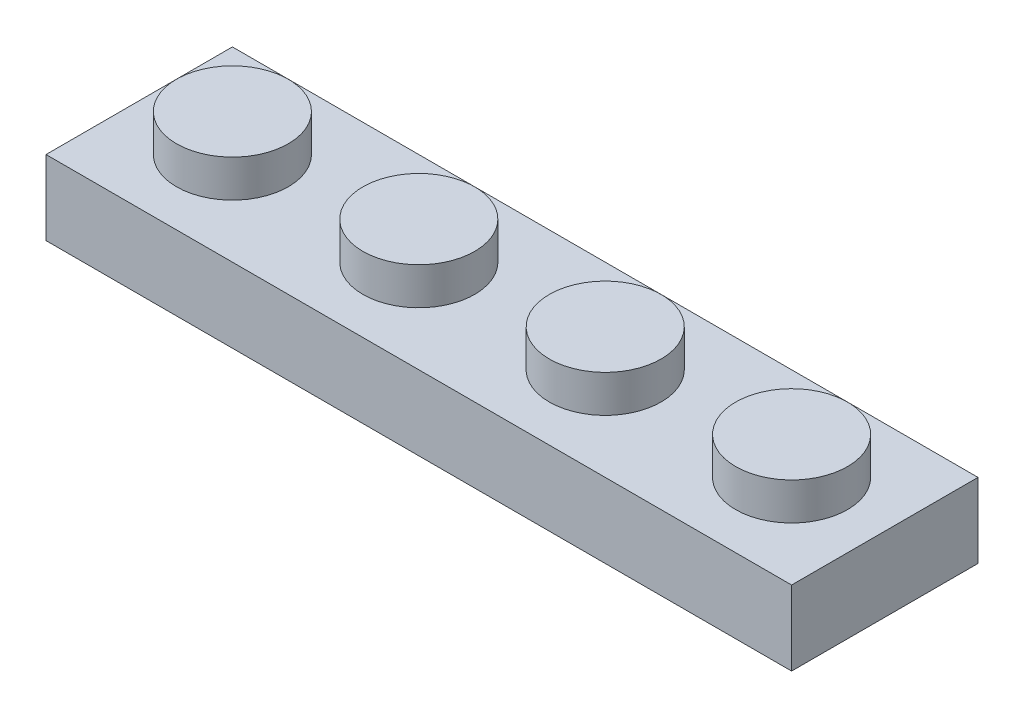
ISO-10303-21;
HEADER;
FILE_DESCRIPTION(('STEP AP214'),'2;1');
FILE_NAME('part.step','',(''),(''),'','','');
FILE_SCHEMA(('AUTOMOTIVE_DESIGN { 1 0 10303 214 1 1 1 1 }'));
ENDSEC;
DATA;
#1=APPLICATION_CONTEXT('core data for automotive mechanical design processes');
#2=APPLICATION_PROTOCOL_DEFINITION('international standard','automotive_design',2000,#1);
#3=PRODUCT_CONTEXT('',#1,'mechanical');
#4=PRODUCT('Part','Part','',(#3));
#5=PRODUCT_RELATED_PRODUCT_CATEGORY('part','',(#4));
#6=PRODUCT_DEFINITION_FORMATION('','',#4);
#7=PRODUCT_DEFINITION_CONTEXT('part definition',#1,'design');
#8=PRODUCT_DEFINITION('design','',#6,#7);
#9=PRODUCT_DEFINITION_SHAPE('','',#8);
#10=(LENGTH_UNIT() NAMED_UNIT(*) SI_UNIT(.MILLI.,.METRE.));
#11=(NAMED_UNIT(*) PLANE_ANGLE_UNIT() SI_UNIT($,.RADIAN.));
#12=(NAMED_UNIT(*) SI_UNIT($,.STERADIAN.) SOLID_ANGLE_UNIT());
#13=UNCERTAINTY_MEASURE_WITH_UNIT(LENGTH_MEASURE(1.E-05),#10,'distance_accuracy_value','');
#14=(GEOMETRIC_REPRESENTATION_CONTEXT(3) GLOBAL_UNCERTAINTY_ASSIGNED_CONTEXT((#13)) GLOBAL_UNIT_ASSIGNED_CONTEXT((#10,
#11,#12)) REPRESENTATION_CONTEXT('',''));
#15=CARTESIAN_POINT('',(0.,0.,0.));
#16=DIRECTION('',(0.,0.,1.));
#17=DIRECTION('',(1.,0.,0.));
#18=AXIS2_PLACEMENT_3D('',#15,#16,#17);
#19=CARTESIAN_POINT('',(-7.5,2.,0.));
#20=DIRECTION('',(0.,-1.,0.));
#21=DIRECTION('',(0.,0.,-1.));
#22=AXIS2_PLACEMENT_3D('',#19,#20,#21);
#23=CYLINDRICAL_SURFACE('',#22,1.5);
#24=CARTESIAN_POINT('',(-7.5,1.,0.));
#25=DIRECTION('',(0.,1.,0.));
#26=DIRECTION('',(0.,0.,1.));
#27=AXIS2_PLACEMENT_3D('',#24,#25,#26);
#28=CIRCLE('',#27,1.5);
#29=CARTESIAN_POINT('',(-7.5,1.,1.5));
#30=VERTEX_POINT('',#29);
#31=EDGE_CURVE('E83',#30,#30,#28,.T.);
#32=ORIENTED_EDGE('',*,*,#31,.T.);
#33=EDGE_LOOP('',(#32));
#34=FACE_BOUND('',#33,.T.);
#35=CARTESIAN_POINT('',(-7.5,2.,0.));
#36=DIRECTION('',(0.,1.,0.));
#37=DIRECTION('',(0.,0.,1.));
#38=AXIS2_PLACEMENT_3D('',#35,#36,#37);
#39=CIRCLE('',#38,1.5);
#40=CARTESIAN_POINT('',(-7.5,2.,1.5));
#41=VERTEX_POINT('',#40);
#42=EDGE_CURVE('E12',#41,#41,#39,.T.);
#43=ORIENTED_EDGE('',*,*,#42,.F.);
#44=EDGE_LOOP('',(#43));
#45=FACE_BOUND('',#44,.T.);
#46=ADVANCED_FACE('F80',(#34,#45),#23,.T.);
#47=CARTESIAN_POINT('',(0.,2.,0.));
#48=DIRECTION('',(0.,1.,0.));
#49=DIRECTION('',(0.,0.,1.));
#50=AXIS2_PLACEMENT_3D('',#47,#48,#49);
#51=PLANE('',#50);
#52=ORIENTED_EDGE('',*,*,#42,.T.);
#53=EDGE_LOOP('',(#52));
#54=FACE_BOUND('',#53,.T.);
#55=ADVANCED_FACE('F294',(#54),#51,.T.);
#56=CARTESIAN_POINT('',(-10.,1.,2.5));
#57=DIRECTION('',(0.,0.,-1.));
#58=DIRECTION('',(-1.,0.,0.));
#59=AXIS2_PLACEMENT_3D('',#56,#57,#58);
#60=PLANE('',#59);
#61=DIRECTION('',(0.,-1.,0.));
#62=VECTOR('',#61,1.);
#63=CARTESIAN_POINT('',(-10.,1.,2.5));
#64=LINE('',#63,#62);
#65=CARTESIAN_POINT('',(-10.,1.,2.5));
#66=VERTEX_POINT('',#65);
#67=CARTESIAN_POINT('',(-10.,-1.,2.5));
#68=VERTEX_POINT('',#67);
#69=EDGE_CURVE('E251',#66,#68,#64,.T.);
#70=ORIENTED_EDGE('',*,*,#69,.T.);
#71=DIRECTION('',(1.,0.,0.));
#72=VECTOR('',#71,1.);
#73=CARTESIAN_POINT('',(0.,-1.,2.5));
#74=LINE('',#73,#72);
#75=CARTESIAN_POINT('',(10.,-1.,2.5));
#76=VERTEX_POINT('',#75);
#77=EDGE_CURVE('E178',#68,#76,#74,.T.);
#78=ORIENTED_EDGE('',*,*,#77,.T.);
#79=DIRECTION('',(0.,-1.,0.));
#80=VECTOR('',#79,1.);
#81=CARTESIAN_POINT('',(10.,1.,2.5));
#82=LINE('',#81,#80);
#83=CARTESIAN_POINT('',(10.,1.,2.5));
#84=VERTEX_POINT('',#83);
#85=EDGE_CURVE('E257',#84,#76,#82,.T.);
#86=ORIENTED_EDGE('',*,*,#85,.F.);
#87=DIRECTION('',(1.,0.,0.));
#88=VECTOR('',#87,1.);
#89=CARTESIAN_POINT('',(-10.,1.,2.5));
#90=LINE('',#89,#88);
#91=EDGE_CURVE('E240',#66,#84,#90,.T.);
#92=ORIENTED_EDGE('',*,*,#91,.F.);
#93=EDGE_LOOP('',(#70,#78,#86,#92));
#94=FACE_BOUND('',#93,.T.);
#95=ADVANCED_FACE('F278',(#94),#60,.F.);
#96=CARTESIAN_POINT('',(10.,1.,2.5));
#97=DIRECTION('',(-1.,0.,0.));
#98=DIRECTION('',(0.,0.,1.));
#99=AXIS2_PLACEMENT_3D('',#96,#97,#98);
#100=PLANE('',#99);
#101=ORIENTED_EDGE('',*,*,#85,.T.);
#102=DIRECTION('',(0.,0.,-1.));
#103=VECTOR('',#102,1.);
#104=CARTESIAN_POINT('',(10.,-1.,0.));
#105=LINE('',#104,#103);
#106=CARTESIAN_POINT('',(10.,-1.,-2.5));
#107=VERTEX_POINT('',#106);
#108=EDGE_CURVE('E181',#76,#107,#105,.T.);
#109=ORIENTED_EDGE('',*,*,#108,.T.);
#110=DIRECTION('',(0.,-1.,0.));
#111=VECTOR('',#110,1.);
#112=CARTESIAN_POINT('',(10.,1.,-2.5));
#113=LINE('',#112,#111);
#114=CARTESIAN_POINT('',(10.,1.,-2.5));
#115=VERTEX_POINT('',#114);
#116=EDGE_CURVE('E255',#115,#107,#113,.T.);
#117=ORIENTED_EDGE('',*,*,#116,.F.);
#118=DIRECTION('',(0.,0.,-1.));
#119=VECTOR('',#118,1.);
#120=CARTESIAN_POINT('',(10.,1.,2.5));
#121=LINE('',#120,#119);
#122=EDGE_CURVE('E243',#84,#115,#121,.T.);
#123=ORIENTED_EDGE('',*,*,#122,.F.);
#124=EDGE_LOOP('',(#101,#109,#117,#123));
#125=FACE_BOUND('',#124,.T.);
#126=ADVANCED_FACE('F282',(#125),#100,.F.);
#127=CARTESIAN_POINT('',(-10.,1.,-2.5));
#128=DIRECTION('',(0.,0.,-1.));
#129=DIRECTION('',(-1.,0.,0.));
#130=AXIS2_PLACEMENT_3D('',#127,#128,#129);
#131=PLANE('',#130);
#132=ORIENTED_EDGE('',*,*,#116,.T.);
#133=DIRECTION('',(1.,0.,0.));
#134=VECTOR('',#133,1.);
#135=CARTESIAN_POINT('',(0.,-1.,-2.5));
#136=LINE('',#135,#134);
#137=CARTESIAN_POINT('',(-10.,-1.,-2.5));
#138=VERTEX_POINT('',#137);
#139=EDGE_CURVE('E184',#138,#107,#136,.T.);
#140=ORIENTED_EDGE('',*,*,#139,.F.);
#141=DIRECTION('',(0.,-1.,0.));
#142=VECTOR('',#141,1.);
#143=CARTESIAN_POINT('',(-10.,1.,-2.5));
#144=LINE('',#143,#142);
#145=CARTESIAN_POINT('',(-10.,1.,-2.5));
#146=VERTEX_POINT('',#145);
#147=EDGE_CURVE('E253',#146,#138,#144,.T.);
#148=ORIENTED_EDGE('',*,*,#147,.F.);
#149=DIRECTION('',(1.,0.,0.));
#150=VECTOR('',#149,1.);
#151=CARTESIAN_POINT('',(-10.,1.,-2.5));
#152=LINE('',#151,#150);
#153=EDGE_CURVE('E245',#146,#115,#152,.T.);
#154=ORIENTED_EDGE('',*,*,#153,.T.);
#155=EDGE_LOOP('',(#132,#140,#148,#154));
#156=FACE_BOUND('',#155,.T.);
#157=ADVANCED_FACE('F284',(#156),#131,.T.);
#158=CARTESIAN_POINT('',(-10.,1.,2.5));
#159=DIRECTION('',(-1.,0.,0.));
#160=DIRECTION('',(0.,0.,1.));
#161=AXIS2_PLACEMENT_3D('',#158,#159,#160);
#162=PLANE('',#161);
#163=ORIENTED_EDGE('',*,*,#147,.T.);
#164=DIRECTION('',(0.,0.,-1.));
#165=VECTOR('',#164,1.);
#166=CARTESIAN_POINT('',(-10.,-1.,0.));
#167=LINE('',#166,#165);
#168=EDGE_CURVE('E164',#68,#138,#167,.T.);
#169=ORIENTED_EDGE('',*,*,#168,.F.);
#170=ORIENTED_EDGE('',*,*,#69,.F.);
#171=DIRECTION('',(0.,0.,-1.));
#172=VECTOR('',#171,1.);
#173=CARTESIAN_POINT('',(-10.,1.,2.5));
#174=LINE('',#173,#172);
#175=EDGE_CURVE('E248',#66,#146,#174,.T.);
#176=ORIENTED_EDGE('',*,*,#175,.T.);
#177=EDGE_LOOP('',(#163,#169,#170,#176));
#178=FACE_BOUND('',#177,.T.);
#179=ADVANCED_FACE('F270',(#178),#162,.T.);
#180=CARTESIAN_POINT('',(0.,1.,0.));
#181=DIRECTION('',(0.,1.,0.));
#182=DIRECTION('',(0.,0.,1.));
#183=AXIS2_PLACEMENT_3D('',#180,#181,#182);
#184=PLANE('',#183);
#185=CARTESIAN_POINT('',(7.5,1.,0.));
#186=DIRECTION('',(0.,1.,0.));
#187=DIRECTION('',(0.,0.,1.));
#188=AXIS2_PLACEMENT_3D('',#185,#186,#187);
#189=CIRCLE('',#188,1.5);
#190=CARTESIAN_POINT('',(7.5,1.,1.5));
#191=VERTEX_POINT('',#190);
#192=EDGE_CURVE('E225',#191,#191,#189,.F.);
#193=ORIENTED_EDGE('',*,*,#192,.T.);
#194=EDGE_LOOP('',(#193));
#195=FACE_BOUND('',#194,.T.);
#196=CARTESIAN_POINT('',(2.5,1.,0.));
#197=DIRECTION('',(0.,1.,0.));
#198=DIRECTION('',(0.,0.,1.));
#199=AXIS2_PLACEMENT_3D('',#196,#197,#198);
#200=CIRCLE('',#199,1.5);
#201=CARTESIAN_POINT('',(2.5,1.,1.5));
#202=VERTEX_POINT('',#201);
#203=EDGE_CURVE('E231',#202,#202,#200,.F.);
#204=ORIENTED_EDGE('',*,*,#203,.T.);
#205=EDGE_LOOP('',(#204));
#206=FACE_BOUND('',#205,.T.);
#207=CARTESIAN_POINT('',(-2.5,1.,0.));
#208=DIRECTION('',(0.,1.,0.));
#209=DIRECTION('',(0.,0.,1.));
#210=AXIS2_PLACEMENT_3D('',#207,#208,#209);
#211=CIRCLE('',#210,1.5);
#212=CARTESIAN_POINT('',(-2.5,1.,1.5));
#213=VERTEX_POINT('',#212);
#214=EDGE_CURVE('E237',#213,#213,#211,.F.);
#215=ORIENTED_EDGE('',*,*,#214,.T.);
#216=EDGE_LOOP('',(#215));
#217=FACE_BOUND('',#216,.T.);
#218=ORIENTED_EDGE('',*,*,#31,.F.);
#219=EDGE_LOOP('',(#218));
#220=FACE_BOUND('',#219,.T.);
#221=ORIENTED_EDGE('',*,*,#91,.T.);
#222=ORIENTED_EDGE('',*,*,#122,.T.);
#223=ORIENTED_EDGE('',*,*,#153,.F.);
#224=ORIENTED_EDGE('',*,*,#175,.F.);
#225=EDGE_LOOP('',(#221,#222,#223,#224));
#226=FACE_BOUND('',#225,.T.);
#227=ADVANCED_FACE('F266',(#195,#206,#217,#220,#226),#184,.T.);
#228=CARTESIAN_POINT('',(-2.5,2.,0.));
#229=DIRECTION('',(0.,-1.,0.));
#230=DIRECTION('',(0.,0.,-1.));
#231=AXIS2_PLACEMENT_3D('',#228,#229,#230);
#232=CYLINDRICAL_SURFACE('',#231,1.5);
#233=ORIENTED_EDGE('',*,*,#214,.F.);
#234=EDGE_LOOP('',(#233));
#235=FACE_BOUND('',#234,.T.);
#236=CARTESIAN_POINT('',(-2.5,2.,0.));
#237=DIRECTION('',(0.,1.,0.));
#238=DIRECTION('',(0.,0.,1.));
#239=AXIS2_PLACEMENT_3D('',#236,#237,#238);
#240=CIRCLE('',#239,1.5);
#241=CARTESIAN_POINT('',(-2.5,2.,1.5));
#242=VERTEX_POINT('',#241);
#243=EDGE_CURVE('E234',#242,#242,#240,.T.);
#244=ORIENTED_EDGE('',*,*,#243,.F.);
#245=EDGE_LOOP('',(#244));
#246=FACE_BOUND('',#245,.T.);
#247=ADVANCED_FACE('F269',(#235,#246),#232,.T.);
#248=CARTESIAN_POINT('',(0.,2.,0.));
#249=DIRECTION('',(0.,1.,0.));
#250=DIRECTION('',(0.,0.,1.));
#251=AXIS2_PLACEMENT_3D('',#248,#249,#250);
#252=PLANE('',#251);
#253=ORIENTED_EDGE('',*,*,#243,.T.);
#254=EDGE_LOOP('',(#253));
#255=FACE_BOUND('',#254,.T.);
#256=ADVANCED_FACE('F397',(#255),#252,.T.);
#257=CARTESIAN_POINT('',(2.5,2.,0.));
#258=DIRECTION('',(0.,-1.,0.));
#259=DIRECTION('',(0.,0.,-1.));
#260=AXIS2_PLACEMENT_3D('',#257,#258,#259);
#261=CYLINDRICAL_SURFACE('',#260,1.5);
#262=ORIENTED_EDGE('',*,*,#203,.F.);
#263=EDGE_LOOP('',(#262));
#264=FACE_BOUND('',#263,.T.);
#265=CARTESIAN_POINT('',(2.5,2.,0.));
#266=DIRECTION('',(0.,1.,0.));
#267=DIRECTION('',(0.,0.,1.));
#268=AXIS2_PLACEMENT_3D('',#265,#266,#267);
#269=CIRCLE('',#268,1.5);
#270=CARTESIAN_POINT('',(2.5,2.,1.5));
#271=VERTEX_POINT('',#270);
#272=EDGE_CURVE('E228',#271,#271,#269,.T.);
#273=ORIENTED_EDGE('',*,*,#272,.F.);
#274=EDGE_LOOP('',(#273));
#275=FACE_BOUND('',#274,.T.);
#276=ADVANCED_FACE('F393',(#264,#275),#261,.T.);
#277=CARTESIAN_POINT('',(0.,2.,0.));
#278=DIRECTION('',(0.,1.,0.));
#279=DIRECTION('',(0.,0.,1.));
#280=AXIS2_PLACEMENT_3D('',#277,#278,#279);
#281=PLANE('',#280);
#282=ORIENTED_EDGE('',*,*,#272,.T.);
#283=EDGE_LOOP('',(#282));
#284=FACE_BOUND('',#283,.T.);
#285=ADVANCED_FACE('F389',(#284),#281,.T.);
#286=CARTESIAN_POINT('',(7.5,2.,0.));
#287=DIRECTION('',(0.,-1.,0.));
#288=DIRECTION('',(0.,0.,-1.));
#289=AXIS2_PLACEMENT_3D('',#286,#287,#288);
#290=CYLINDRICAL_SURFACE('',#289,1.5);
#291=ORIENTED_EDGE('',*,*,#192,.F.);
#292=EDGE_LOOP('',(#291));
#293=FACE_BOUND('',#292,.T.);
#294=CARTESIAN_POINT('',(7.5,2.,0.));
#295=DIRECTION('',(0.,1.,0.));
#296=DIRECTION('',(0.,0.,1.));
#297=AXIS2_PLACEMENT_3D('',#294,#295,#296);
#298=CIRCLE('',#297,1.5);
#299=CARTESIAN_POINT('',(7.5,2.,1.5));
#300=VERTEX_POINT('',#299);
#301=EDGE_CURVE('E220',#300,#300,#298,.T.);
#302=ORIENTED_EDGE('',*,*,#301,.F.);
#303=EDGE_LOOP('',(#302));
#304=FACE_BOUND('',#303,.T.);
#305=ADVANCED_FACE('F385',(#293,#304),#290,.T.);
#306=CARTESIAN_POINT('',(0.,2.,0.));
#307=DIRECTION('',(0.,1.,0.));
#308=DIRECTION('',(0.,0.,1.));
#309=AXIS2_PLACEMENT_3D('',#306,#307,#308);
#310=PLANE('',#309);
#311=ORIENTED_EDGE('',*,*,#301,.T.);
#312=EDGE_LOOP('',(#311));
#313=FACE_BOUND('',#312,.T.);
#314=ADVANCED_FACE('F350',(#313),#310,.T.);
#315=CARTESIAN_POINT('',(9.,-1.,0.));
#316=DIRECTION('',(1.,0.,0.));
#317=DIRECTION('',(0.,0.,-1.));
#318=AXIS2_PLACEMENT_3D('',#315,#316,#317);
#319=PLANE('',#318);
#320=DIRECTION('',(0.,0.,-1.));
#321=VECTOR('',#320,1.);
#322=CARTESIAN_POINT('',(9.,0.,0.));
#323=LINE('',#322,#321);
#324=CARTESIAN_POINT('',(9.,0.,1.5));
#325=VERTEX_POINT('',#324);
#326=CARTESIAN_POINT('',(9.,0.,-1.5));
#327=VERTEX_POINT('',#326);
#328=EDGE_CURVE('E189',#325,#327,#323,.T.);
#329=ORIENTED_EDGE('',*,*,#328,.T.);
#330=DIRECTION('',(0.,1.,0.));
#331=VECTOR('',#330,1.);
#332=CARTESIAN_POINT('',(9.,-1.,-1.5));
#333=LINE('',#332,#331);
#334=CARTESIAN_POINT('',(9.,-1.,-1.5));
#335=VERTEX_POINT('',#334);
#336=EDGE_CURVE('E167',#335,#327,#333,.T.);
#337=ORIENTED_EDGE('',*,*,#336,.F.);
#338=DIRECTION('',(0.,0.,-1.));
#339=VECTOR('',#338,1.);
#340=CARTESIAN_POINT('',(9.,-1.,0.));
#341=LINE('',#340,#339);
#342=CARTESIAN_POINT('',(9.,-1.,1.5));
#343=VERTEX_POINT('',#342);
#344=EDGE_CURVE('E149',#343,#335,#341,.T.);
#345=ORIENTED_EDGE('',*,*,#344,.F.);
#346=DIRECTION('',(0.,1.,0.));
#347=VECTOR('',#346,1.);
#348=CARTESIAN_POINT('',(9.,-1.,1.5));
#349=LINE('',#348,#347);
#350=EDGE_CURVE('E158',#343,#325,#349,.T.);
#351=ORIENTED_EDGE('',*,*,#350,.T.);
#352=EDGE_LOOP('',(#329,#337,#345,#351));
#353=FACE_BOUND('',#352,.T.);
#354=ADVANCED_FACE('F166',(#353),#319,.F.);
#355=CARTESIAN_POINT('',(0.,-1.,-1.5));
#356=DIRECTION('',(0.,0.,1.));
#357=DIRECTION('',(1.,0.,0.));
#358=AXIS2_PLACEMENT_3D('',#355,#356,#357);
#359=PLANE('',#358);
#360=DIRECTION('',(1.,0.,0.));
#361=VECTOR('',#360,1.);
#362=CARTESIAN_POINT('',(0.,0.,-1.5));
#363=LINE('',#362,#361);
#364=CARTESIAN_POINT('',(-9.,0.,-1.5));
#365=VERTEX_POINT('',#364);
#366=EDGE_CURVE('E94',#365,#327,#363,.T.);
#367=ORIENTED_EDGE('',*,*,#366,.F.);
#368=DIRECTION('',(0.,1.,0.));
#369=VECTOR('',#368,1.);
#370=CARTESIAN_POINT('',(-9.,-1.,-1.5));
#371=LINE('',#370,#369);
#372=CARTESIAN_POINT('',(-9.,-1.,-1.5));
#373=VERTEX_POINT('',#372);
#374=EDGE_CURVE('E196',#373,#365,#371,.T.);
#375=ORIENTED_EDGE('',*,*,#374,.F.);
#376=DIRECTION('',(1.,0.,0.));
#377=VECTOR('',#376,1.);
#378=CARTESIAN_POINT('',(0.,-1.,-1.5));
#379=LINE('',#378,#377);
#380=EDGE_CURVE('E176',#373,#335,#379,.T.);
#381=ORIENTED_EDGE('',*,*,#380,.T.);
#382=ORIENTED_EDGE('',*,*,#336,.T.);
#383=EDGE_LOOP('',(#367,#375,#381,#382));
#384=FACE_BOUND('',#383,.T.);
#385=ADVANCED_FACE('F343',(#384),#359,.T.);
#386=CARTESIAN_POINT('',(-9.,-1.,0.));
#387=DIRECTION('',(1.,0.,0.));
#388=DIRECTION('',(0.,0.,-1.));
#389=AXIS2_PLACEMENT_3D('',#386,#387,#388);
#390=PLANE('',#389);
#391=DIRECTION('',(0.,0.,-1.));
#392=VECTOR('',#391,1.);
#393=CARTESIAN_POINT('',(-9.,0.,0.));
#394=LINE('',#393,#392);
#395=CARTESIAN_POINT('',(-9.,0.,1.5));
#396=VERTEX_POINT('',#395);
#397=EDGE_CURVE('E99',#396,#365,#394,.T.);
#398=ORIENTED_EDGE('',*,*,#397,.F.);
#399=DIRECTION('',(0.,1.,0.));
#400=VECTOR('',#399,1.);
#401=CARTESIAN_POINT('',(-9.,-1.,1.5));
#402=LINE('',#401,#400);
#403=CARTESIAN_POINT('',(-9.,-1.,1.5));
#404=VERTEX_POINT('',#403);
#405=EDGE_CURVE('E163',#404,#396,#402,.T.);
#406=ORIENTED_EDGE('',*,*,#405,.F.);
#407=DIRECTION('',(0.,0.,-1.));
#408=VECTOR('',#407,1.);
#409=CARTESIAN_POINT('',(-9.,-1.,0.));
#410=LINE('',#409,#408);
#411=EDGE_CURVE('E152',#404,#373,#410,.T.);
#412=ORIENTED_EDGE('',*,*,#411,.T.);
#413=ORIENTED_EDGE('',*,*,#374,.T.);
#414=EDGE_LOOP('',(#398,#406,#412,#413));
#415=FACE_BOUND('',#414,.T.);
#416=ADVANCED_FACE('F341',(#415),#390,.T.);
#417=CARTESIAN_POINT('',(0.,-1.,1.5));
#418=DIRECTION('',(0.,0.,1.));
#419=DIRECTION('',(1.,0.,0.));
#420=AXIS2_PLACEMENT_3D('',#417,#418,#419);
#421=PLANE('',#420);
#422=DIRECTION('',(1.,0.,0.));
#423=VECTOR('',#422,1.);
#424=CARTESIAN_POINT('',(0.,0.,1.5));
#425=LINE('',#424,#423);
#426=EDGE_CURVE('E160',#396,#325,#425,.T.);
#427=ORIENTED_EDGE('',*,*,#426,.T.);
#428=ORIENTED_EDGE('',*,*,#350,.F.);
#429=DIRECTION('',(1.,0.,0.));
#430=VECTOR('',#429,1.);
#431=CARTESIAN_POINT('',(0.,-1.,1.5));
#432=LINE('',#431,#430);
#433=EDGE_CURVE('E143',#404,#343,#432,.T.);
#434=ORIENTED_EDGE('',*,*,#433,.F.);
#435=ORIENTED_EDGE('',*,*,#405,.T.);
#436=EDGE_LOOP('',(#427,#428,#434,#435));
#437=FACE_BOUND('',#436,.T.);
#438=ADVANCED_FACE('F159',(#437),#421,.F.);
#439=CARTESIAN_POINT('',(0.,-1.,0.));
#440=DIRECTION('',(0.,1.,0.));
#441=DIRECTION('',(0.,0.,1.));
#442=AXIS2_PLACEMENT_3D('',#439,#440,#441);
#443=PLANE('',#442);
#444=ORIENTED_EDGE('',*,*,#344,.T.);
#445=ORIENTED_EDGE('',*,*,#380,.F.);
#446=ORIENTED_EDGE('',*,*,#411,.F.);
#447=ORIENTED_EDGE('',*,*,#433,.T.);
#448=EDGE_LOOP('',(#444,#445,#446,#447));
#449=FACE_BOUND('',#448,.T.);
#450=ORIENTED_EDGE('',*,*,#77,.F.);
#451=ORIENTED_EDGE('',*,*,#168,.T.);
#452=ORIENTED_EDGE('',*,*,#139,.T.);
#453=ORIENTED_EDGE('',*,*,#108,.F.);
#454=EDGE_LOOP('',(#450,#451,#452,#453));
#455=FACE_BOUND('',#454,.T.);
#456=ADVANCED_FACE('F145',(#449,#455),#443,.F.);
#457=CARTESIAN_POINT('',(0.,1.,0.));
#458=DIRECTION('',(0.,1.,0.));
#459=DIRECTION('',(0.,0.,1.));
#460=AXIS2_PLACEMENT_3D('',#457,#458,#459);
#461=PLANE('',#460);
#462=CARTESIAN_POINT('',(-2.5,1.,0.));
#463=DIRECTION('',(0.,1.,0.));
#464=DIRECTION('',(0.,0.,1.));
#465=AXIS2_PLACEMENT_3D('',#462,#463,#464);
#466=CIRCLE('',#465,0.75);
#467=CARTESIAN_POINT('',(-2.5,1.,0.75));
#468=VERTEX_POINT('',#467);
#469=EDGE_CURVE('E199',#468,#468,#466,.T.);
#470=ORIENTED_EDGE('',*,*,#469,.F.);
#471=EDGE_LOOP('',(#470));
#472=FACE_BOUND('',#471,.T.);
#473=ADVANCED_FACE('F356',(#472),#461,.F.);
#474=CARTESIAN_POINT('',(0.,1.,0.));
#475=DIRECTION('',(0.,1.,0.));
#476=DIRECTION('',(0.,0.,1.));
#477=AXIS2_PLACEMENT_3D('',#474,#475,#476);
#478=PLANE('',#477);
#479=CARTESIAN_POINT('',(2.5,1.,0.));
#480=DIRECTION('',(0.,1.,0.));
#481=DIRECTION('',(0.,0.,1.));
#482=AXIS2_PLACEMENT_3D('',#479,#480,#481);
#483=CIRCLE('',#482,0.75);
#484=CARTESIAN_POINT('',(2.5,1.,0.75));
#485=VERTEX_POINT('',#484);
#486=EDGE_CURVE('E206',#485,#485,#483,.T.);
#487=ORIENTED_EDGE('',*,*,#486,.F.);
#488=EDGE_LOOP('',(#487));
#489=FACE_BOUND('',#488,.T.);
#490=ADVANCED_FACE('F359',(#489),#478,.F.);
#491=CARTESIAN_POINT('',(0.,1.,0.));
#492=DIRECTION('',(0.,1.,0.));
#493=DIRECTION('',(0.,0.,1.));
#494=AXIS2_PLACEMENT_3D('',#491,#492,#493);
#495=PLANE('',#494);
#496=CARTESIAN_POINT('',(7.5,1.,0.));
#497=DIRECTION('',(0.,1.,0.));
#498=DIRECTION('',(0.,0.,1.));
#499=AXIS2_PLACEMENT_3D('',#496,#497,#498);
#500=CIRCLE('',#499,0.75);
#501=CARTESIAN_POINT('',(7.5,1.,0.75));
#502=VERTEX_POINT('',#501);
#503=EDGE_CURVE('E212',#502,#502,#500,.T.);
#504=ORIENTED_EDGE('',*,*,#503,.F.);
#505=EDGE_LOOP('',(#504));
#506=FACE_BOUND('',#505,.T.);
#507=ADVANCED_FACE('F369',(#506),#495,.F.);
#508=CARTESIAN_POINT('',(0.,1.,0.));
#509=DIRECTION('',(0.,1.,0.));
#510=DIRECTION('',(0.,0.,1.));
#511=AXIS2_PLACEMENT_3D('',#508,#509,#510);
#512=PLANE('',#511);
#513=CARTESIAN_POINT('',(-7.5,1.,0.));
#514=DIRECTION('',(0.,1.,0.));
#515=DIRECTION('',(0.,0.,1.));
#516=AXIS2_PLACEMENT_3D('',#513,#514,#515);
#517=CIRCLE('',#516,0.75);
#518=CARTESIAN_POINT('',(-7.5,1.,0.75));
#519=VERTEX_POINT('',#518);
#520=EDGE_CURVE('E217',#519,#519,#517,.T.);
#521=ORIENTED_EDGE('',*,*,#520,.F.);
#522=EDGE_LOOP('',(#521));
#523=FACE_BOUND('',#522,.T.);
#524=ADVANCED_FACE('F365',(#523),#512,.F.);
#525=CARTESIAN_POINT('',(-2.5,1.,0.));
#526=DIRECTION('',(0.,-1.,0.));
#527=DIRECTION('',(0.,0.,-1.));
#528=AXIS2_PLACEMENT_3D('',#525,#526,#527);
#529=CYLINDRICAL_SURFACE('',#528,0.75);
#530=ORIENTED_EDGE('',*,*,#469,.T.);
#531=EDGE_LOOP('',(#530));
#532=FACE_BOUND('',#531,.T.);
#533=CARTESIAN_POINT('',(-2.5,0.,0.));
#534=DIRECTION('',(0.,1.,0.));
#535=DIRECTION('',(0.,0.,1.));
#536=AXIS2_PLACEMENT_3D('',#533,#534,#535);
#537=CIRCLE('',#536,0.75);
#538=CARTESIAN_POINT('',(-2.5,0.,0.75));
#539=VERTEX_POINT('',#538);
#540=EDGE_CURVE('E203',#539,#539,#537,.T.);
#541=ORIENTED_EDGE('',*,*,#540,.F.);
#542=EDGE_LOOP('',(#541));
#543=FACE_BOUND('',#542,.T.);
#544=ADVANCED_FACE('F361',(#532,#543),#529,.F.);
#545=CARTESIAN_POINT('',(2.5,1.,0.));
#546=DIRECTION('',(0.,-1.,0.));
#547=DIRECTION('',(0.,0.,-1.));
#548=AXIS2_PLACEMENT_3D('',#545,#546,#547);
#549=CYLINDRICAL_SURFACE('',#548,0.75);
#550=ORIENTED_EDGE('',*,*,#486,.T.);
#551=EDGE_LOOP('',(#550));
#552=FACE_BOUND('',#551,.T.);
#553=CARTESIAN_POINT('',(2.5,0.,0.));
#554=DIRECTION('',(0.,1.,0.));
#555=DIRECTION('',(0.,0.,1.));
#556=AXIS2_PLACEMENT_3D('',#553,#554,#555);
#557=CIRCLE('',#556,0.75);
#558=CARTESIAN_POINT('',(2.5,0.,0.75));
#559=VERTEX_POINT('',#558);
#560=EDGE_CURVE('E209',#559,#559,#557,.T.);
#561=ORIENTED_EDGE('',*,*,#560,.F.);
#562=EDGE_LOOP('',(#561));
#563=FACE_BOUND('',#562,.T.);
#564=ADVANCED_FACE('F364',(#552,#563),#549,.F.);
#565=CARTESIAN_POINT('',(7.5,1.,0.));
#566=DIRECTION('',(0.,-1.,0.));
#567=DIRECTION('',(0.,0.,-1.));
#568=AXIS2_PLACEMENT_3D('',#565,#566,#567);
#569=CYLINDRICAL_SURFACE('',#568,0.75);
#570=ORIENTED_EDGE('',*,*,#503,.T.);
#571=EDGE_LOOP('',(#570));
#572=FACE_BOUND('',#571,.T.);
#573=CARTESIAN_POINT('',(7.5,0.,0.));
#574=DIRECTION('',(0.,1.,0.));
#575=DIRECTION('',(0.,0.,1.));
#576=AXIS2_PLACEMENT_3D('',#573,#574,#575);
#577=CIRCLE('',#576,0.75);
#578=CARTESIAN_POINT('',(7.5,0.,0.75));
#579=VERTEX_POINT('',#578);
#580=EDGE_CURVE('E195',#579,#579,#577,.T.);
#581=ORIENTED_EDGE('',*,*,#580,.F.);
#582=EDGE_LOOP('',(#581));
#583=FACE_BOUND('',#582,.T.);
#584=ADVANCED_FACE('F319',(#572,#583),#569,.F.);
#585=CARTESIAN_POINT('',(-7.5,1.,0.));
#586=DIRECTION('',(0.,-1.,0.));
#587=DIRECTION('',(0.,0.,-1.));
#588=AXIS2_PLACEMENT_3D('',#585,#586,#587);
#589=CYLINDRICAL_SURFACE('',#588,0.75);
#590=ORIENTED_EDGE('',*,*,#520,.T.);
#591=EDGE_LOOP('',(#590));
#592=FACE_BOUND('',#591,.T.);
#593=CARTESIAN_POINT('',(-7.5,0.,0.));
#594=DIRECTION('',(0.,1.,0.));
#595=DIRECTION('',(0.,0.,1.));
#596=AXIS2_PLACEMENT_3D('',#593,#594,#595);
#597=CIRCLE('',#596,0.75);
#598=CARTESIAN_POINT('',(-7.5,0.,0.75));
#599=VERTEX_POINT('',#598);
#600=EDGE_CURVE('E202',#599,#599,#597,.T.);
#601=ORIENTED_EDGE('',*,*,#600,.F.);
#602=EDGE_LOOP('',(#601));
#603=FACE_BOUND('',#602,.T.);
#604=ADVANCED_FACE('F308',(#592,#603),#589,.F.);
#605=CARTESIAN_POINT('',(0.,0.,0.));
#606=DIRECTION('',(0.,1.,0.));
#607=DIRECTION('',(0.,0.,1.));
#608=AXIS2_PLACEMENT_3D('',#605,#606,#607);
#609=PLANE('',#608);
#610=CARTESIAN_POINT('',(5.,0.,0.));
#611=DIRECTION('',(0.,1.,0.));
#612=DIRECTION('',(0.,0.,1.));
#613=AXIS2_PLACEMENT_3D('',#610,#611,#612);
#614=CIRCLE('',#613,1.);
#615=CARTESIAN_POINT('',(5.,0.,1.));
#616=VERTEX_POINT('',#615);
#617=EDGE_CURVE('E325',#616,#616,#614,.T.);
#618=ORIENTED_EDGE('',*,*,#617,.T.);
#619=EDGE_LOOP('',(#618));
#620=FACE_BOUND('',#619,.T.);
#621=CARTESIAN_POINT('',(0.,0.,0.));
#622=DIRECTION('',(0.,1.,0.));
#623=DIRECTION('',(0.,0.,1.));
#624=AXIS2_PLACEMENT_3D('',#621,#622,#623);
#625=CIRCLE('',#624,1.);
#626=CARTESIAN_POINT('',(0.,0.,1.));
#627=VERTEX_POINT('',#626);
#628=EDGE_CURVE('E329',#627,#627,#625,.T.);
#629=ORIENTED_EDGE('',*,*,#628,.T.);
#630=EDGE_LOOP('',(#629));
#631=FACE_BOUND('',#630,.T.);
#632=CARTESIAN_POINT('',(-5.,0.,0.));
#633=DIRECTION('',(0.,1.,0.));
#634=DIRECTION('',(0.,0.,1.));
#635=AXIS2_PLACEMENT_3D('',#632,#633,#634);
#636=CIRCLE('',#635,1.);
#637=CARTESIAN_POINT('',(-5.,0.,1.));
#638=VERTEX_POINT('',#637);
#639=EDGE_CURVE('E172',#638,#638,#636,.T.);
#640=ORIENTED_EDGE('',*,*,#639,.T.);
#641=EDGE_LOOP('',(#640));
#642=FACE_BOUND('',#641,.T.);
#643=ORIENTED_EDGE('',*,*,#600,.T.);
#644=EDGE_LOOP('',(#643));
#645=FACE_BOUND('',#644,.T.);
#646=ORIENTED_EDGE('',*,*,#580,.T.);
#647=EDGE_LOOP('',(#646));
#648=FACE_BOUND('',#647,.T.);
#649=ORIENTED_EDGE('',*,*,#560,.T.);
#650=EDGE_LOOP('',(#649));
#651=FACE_BOUND('',#650,.T.);
#652=ORIENTED_EDGE('',*,*,#540,.T.);
#653=EDGE_LOOP('',(#652));
#654=FACE_BOUND('',#653,.T.);
#655=ORIENTED_EDGE('',*,*,#328,.F.);
#656=ORIENTED_EDGE('',*,*,#426,.F.);
#657=ORIENTED_EDGE('',*,*,#397,.T.);
#658=ORIENTED_EDGE('',*,*,#366,.T.);
#659=EDGE_LOOP('',(#655,#656,#657,#658));
#660=FACE_BOUND('',#659,.T.);
#661=ADVANCED_FACE('F305',(#620,#631,#642,#645,#648,#651,#654,#660),#609,.F.);
#662=CARTESIAN_POINT('',(-5.,-1.,0.));
#663=DIRECTION('',(0.,1.,0.));
#664=DIRECTION('',(0.,0.,1.));
#665=AXIS2_PLACEMENT_3D('',#662,#663,#664);
#666=CYLINDRICAL_SURFACE('',#665,1.);
#667=CARTESIAN_POINT('',(-5.,-1.,0.));
#668=DIRECTION('',(0.,1.,0.));
#669=DIRECTION('',(0.,0.,1.));
#670=AXIS2_PLACEMENT_3D('',#667,#668,#669);
#671=CIRCLE('',#670,1.);
#672=CARTESIAN_POINT('',(-5.,-1.,1.));
#673=VERTEX_POINT('',#672);
#674=EDGE_CURVE('E191',#673,#673,#671,.T.);
#675=ORIENTED_EDGE('',*,*,#674,.T.);
#676=EDGE_LOOP('',(#675));
#677=FACE_BOUND('',#676,.T.);
#678=ORIENTED_EDGE('',*,*,#639,.F.);
#679=EDGE_LOOP('',(#678));
#680=FACE_BOUND('',#679,.T.);
#681=ADVANCED_FACE('F307',(#677,#680),#666,.T.);
#682=CARTESIAN_POINT('',(0.,-1.,0.));
#683=DIRECTION('',(0.,1.,0.));
#684=DIRECTION('',(0.,0.,1.));
#685=AXIS2_PLACEMENT_3D('',#682,#683,#684);
#686=PLANE('',#685);
#687=ORIENTED_EDGE('',*,*,#674,.F.);
#688=EDGE_LOOP('',(#687));
#689=FACE_BOUND('',#688,.T.);
#690=ADVANCED_FACE('F315',(#689),#686,.F.);
#691=CARTESIAN_POINT('',(0.,-1.,0.));
#692=DIRECTION('',(0.,1.,0.));
#693=DIRECTION('',(0.,0.,1.));
#694=AXIS2_PLACEMENT_3D('',#691,#692,#693);
#695=CYLINDRICAL_SURFACE('',#694,1.);
#696=CARTESIAN_POINT('',(0.,-1.,0.));
#697=DIRECTION('',(0.,1.,0.));
#698=DIRECTION('',(0.,0.,1.));
#699=AXIS2_PLACEMENT_3D('',#696,#697,#698);
#700=CIRCLE('',#699,1.);
#701=CARTESIAN_POINT('',(0.,-1.,1.));
#702=VERTEX_POINT('',#701);
#703=EDGE_CURVE('E581',#702,#702,#700,.T.);
#704=ORIENTED_EDGE('',*,*,#703,.T.);
#705=EDGE_LOOP('',(#704));
#706=FACE_BOUND('',#705,.T.);
#707=ORIENTED_EDGE('',*,*,#628,.F.);
#708=EDGE_LOOP('',(#707));
#709=FACE_BOUND('',#708,.T.);
#710=ADVANCED_FACE('F527',(#706,#709),#695,.T.);
#711=CARTESIAN_POINT('',(0.,-1.,0.));
#712=DIRECTION('',(0.,1.,0.));
#713=DIRECTION('',(0.,0.,1.));
#714=AXIS2_PLACEMENT_3D('',#711,#712,#713);
#715=PLANE('',#714);
#716=ORIENTED_EDGE('',*,*,#703,.F.);
#717=EDGE_LOOP('',(#716));
#718=FACE_BOUND('',#717,.T.);
#719=ADVANCED_FACE('F535',(#718),#715,.F.);
#720=CARTESIAN_POINT('',(5.,-1.,0.));
#721=DIRECTION('',(0.,1.,0.));
#722=DIRECTION('',(0.,0.,1.));
#723=AXIS2_PLACEMENT_3D('',#720,#721,#722);
#724=CYLINDRICAL_SURFACE('',#723,1.);
#725=CARTESIAN_POINT('',(5.,-1.,0.));
#726=DIRECTION('',(0.,1.,0.));
#727=DIRECTION('',(0.,0.,1.));
#728=AXIS2_PLACEMENT_3D('',#725,#726,#727);
#729=CIRCLE('',#728,1.);
#730=CARTESIAN_POINT('',(5.,-1.,1.));
#731=VERTEX_POINT('',#730);
#732=EDGE_CURVE('E579',#731,#731,#729,.T.);
#733=ORIENTED_EDGE('',*,*,#732,.T.);
#734=EDGE_LOOP('',(#733));
#735=FACE_BOUND('',#734,.T.);
#736=ORIENTED_EDGE('',*,*,#617,.F.);
#737=EDGE_LOOP('',(#736));
#738=FACE_BOUND('',#737,.T.);
#739=ADVANCED_FACE('F543',(#735,#738),#724,.T.);
#740=CARTESIAN_POINT('',(0.,-1.,0.));
#741=DIRECTION('',(0.,1.,0.));
#742=DIRECTION('',(0.,0.,1.));
#743=AXIS2_PLACEMENT_3D('',#740,#741,#742);
#744=PLANE('',#743);
#745=ORIENTED_EDGE('',*,*,#732,.F.);
#746=EDGE_LOOP('',(#745));
#747=FACE_BOUND('',#746,.T.);
#748=ADVANCED_FACE('F551',(#747),#744,.F.);
#749=CLOSED_SHELL('',(#46,#55,#95,#126,#157,#179,#227,#247,#256,#276,#285,#305,#314,#354,#385,
#416,#438,#456,#473,#490,#507,#524,#544,#564,#584,#604,#661,#681,#690,#710,#719,#739,#748));
#750=MANIFOLD_SOLID_BREP('B2',#749);
#751=ADVANCED_BREP_SHAPE_REPRESENTATION('',(#18,#750),#14);
#752=SHAPE_DEFINITION_REPRESENTATION(#9,#751);
ENDSEC;
END-ISO-10303-21;
